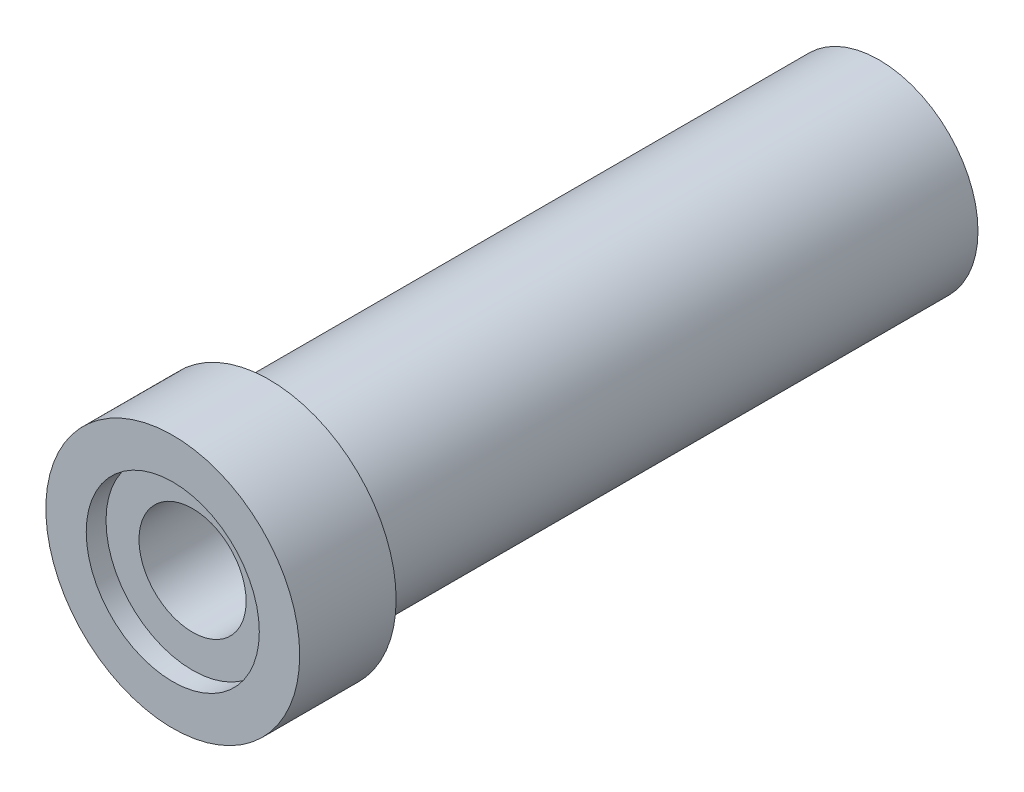
ISO-10303-21;
HEADER;
FILE_DESCRIPTION(('STEP AP214'),'2;1');
FILE_NAME('part.step','',(''),(''),'','','');
FILE_SCHEMA(('AUTOMOTIVE_DESIGN { 1 0 10303 214 1 1 1 1 }'));
ENDSEC;
DATA;
#1=APPLICATION_CONTEXT('core data for automotive mechanical design processes');
#2=APPLICATION_PROTOCOL_DEFINITION('international standard','automotive_design',2000,#1);
#3=PRODUCT_CONTEXT('',#1,'mechanical');
#4=PRODUCT('Part','Part','',(#3));
#5=PRODUCT_RELATED_PRODUCT_CATEGORY('part','',(#4));
#6=PRODUCT_DEFINITION_FORMATION('','',#4);
#7=PRODUCT_DEFINITION_CONTEXT('part definition',#1,'design');
#8=PRODUCT_DEFINITION('design','',#6,#7);
#9=PRODUCT_DEFINITION_SHAPE('','',#8);
#10=(LENGTH_UNIT() NAMED_UNIT(*) SI_UNIT(.MILLI.,.METRE.));
#11=(NAMED_UNIT(*) PLANE_ANGLE_UNIT() SI_UNIT($,.RADIAN.));
#12=(NAMED_UNIT(*) SI_UNIT($,.STERADIAN.) SOLID_ANGLE_UNIT());
#13=UNCERTAINTY_MEASURE_WITH_UNIT(LENGTH_MEASURE(1.E-05),#10,'distance_accuracy_value','');
#14=(GEOMETRIC_REPRESENTATION_CONTEXT(3) GLOBAL_UNCERTAINTY_ASSIGNED_CONTEXT((#13)) GLOBAL_UNIT_ASSIGNED_CONTEXT((#10,
#11,#12)) REPRESENTATION_CONTEXT('',''));
#15=CARTESIAN_POINT('',(0.,0.,0.));
#16=DIRECTION('',(0.,0.,1.));
#17=DIRECTION('',(1.,0.,0.));
#18=AXIS2_PLACEMENT_3D('',#15,#16,#17);
#19=CARTESIAN_POINT('',(0.,0.,-7.));
#20=DIRECTION('',(0.,0.,-1.));
#21=DIRECTION('',(-1.,0.,0.));
#22=AXIS2_PLACEMENT_3D('',#19,#20,#21);
#23=PLANE('',#22);
#24=CARTESIAN_POINT('',(0.,0.,-7.));
#25=DIRECTION('',(0.,0.,-1.));
#26=DIRECTION('',(-1.,0.,0.));
#27=AXIS2_PLACEMENT_3D('',#24,#25,#26);
#28=CIRCLE('',#27,3.25);
#29=CARTESIAN_POINT('',(-3.25,0.,-7.));
#30=VERTEX_POINT('',#29);
#31=EDGE_CURVE('E273',#30,#30,#28,.T.);
#32=ORIENTED_EDGE('',*,*,#31,.F.);
#33=EDGE_LOOP('',(#32));
#34=FACE_BOUND('',#33,.T.);
#35=CARTESIAN_POINT('',(0.,0.,-7.));
#36=DIRECTION('',(0.,0.,-1.));
#37=DIRECTION('',(-1.,0.,0.));
#38=AXIS2_PLACEMENT_3D('',#35,#36,#37);
#39=CIRCLE('',#38,4.6);
#40=CARTESIAN_POINT('',(-4.6,0.,-7.));
#41=VERTEX_POINT('',#40);
#42=EDGE_CURVE('E355',#41,#41,#39,.T.);
#43=ORIENTED_EDGE('',*,*,#42,.T.);
#44=EDGE_LOOP('',(#43));
#45=FACE_BOUND('',#44,.T.);
#46=ADVANCED_FACE('F252',(#34,#45),#23,.T.);
#47=CARTESIAN_POINT('',(0.,0.,5.85));
#48=DIRECTION('',(0.,0.,-1.));
#49=DIRECTION('',(-1.,0.,0.));
#50=AXIS2_PLACEMENT_3D('',#47,#48,#49);
#51=CYLINDRICAL_SURFACE('',#50,3.25);
#52=CARTESIAN_POINT('',(0.,0.,4.65));
#53=DIRECTION('',(0.,0.,1.));
#54=DIRECTION('',(1.,0.,0.));
#55=AXIS2_PLACEMENT_3D('',#52,#53,#54);
#56=CIRCLE('',#55,3.25);
#57=CARTESIAN_POINT('',(3.25,0.,4.65));
#58=VERTEX_POINT('',#57);
#59=EDGE_CURVE('E256',#58,#58,#56,.T.);
#60=ORIENTED_EDGE('',*,*,#59,.T.);
#61=EDGE_LOOP('',(#60));
#62=FACE_BOUND('',#61,.T.);
#63=ORIENTED_EDGE('',*,*,#31,.T.);
#64=EDGE_LOOP('',(#63));
#65=FACE_BOUND('',#64,.T.);
#66=ADVANCED_FACE('F294',(#62,#65),#51,.F.);
#67=CARTESIAN_POINT('',(0.,0.,5.85));
#68=DIRECTION('',(0.,0.,1.));
#69=DIRECTION('',(1.,0.,0.));
#70=AXIS2_PLACEMENT_3D('',#67,#68,#69);
#71=PLANE('',#70);
#72=CARTESIAN_POINT('',(0.,0.,5.85));
#73=DIRECTION('',(0.,0.,1.));
#74=DIRECTION('',(1.,0.,0.));
#75=AXIS2_PLACEMENT_3D('',#72,#73,#74);
#76=CIRCLE('',#75,5.25);
#77=CARTESIAN_POINT('',(5.25,0.,5.85));
#78=VERTEX_POINT('',#77);
#79=EDGE_CURVE('E279',#78,#78,#76,.T.);
#80=ORIENTED_EDGE('',*,*,#79,.F.);
#81=EDGE_LOOP('',(#80));
#82=FACE_BOUND('',#81,.T.);
#83=CARTESIAN_POINT('',(0.,0.,5.85));
#84=DIRECTION('',(0.,0.,1.));
#85=DIRECTION('',(1.,0.,0.));
#86=AXIS2_PLACEMENT_3D('',#83,#84,#85);
#87=CIRCLE('',#86,7.7);
#88=CARTESIAN_POINT('',(7.7,0.,5.85));
#89=VERTEX_POINT('',#88);
#90=EDGE_CURVE('E261',#89,#89,#87,.T.);
#91=ORIENTED_EDGE('',*,*,#90,.T.);
#92=EDGE_LOOP('',(#91));
#93=FACE_BOUND('',#92,.T.);
#94=ADVANCED_FACE('F310',(#82,#93),#71,.T.);
#95=CARTESIAN_POINT('',(0.,0.,0.));
#96=DIRECTION('',(0.,0.,1.));
#97=DIRECTION('',(1.,0.,0.));
#98=AXIS2_PLACEMENT_3D('',#95,#96,#97);
#99=PLANE('',#98);
#100=CARTESIAN_POINT('',(0.,0.,0.));
#101=DIRECTION('',(0.,0.,-1.));
#102=DIRECTION('',(-1.,0.,0.));
#103=AXIS2_PLACEMENT_3D('',#100,#101,#102);
#104=CIRCLE('',#103,6.);
#105=CARTESIAN_POINT('',(-6.,0.,0.));
#106=VERTEX_POINT('',#105);
#107=EDGE_CURVE('E11',#106,#106,#104,.T.);
#108=ORIENTED_EDGE('',*,*,#107,.F.);
#109=EDGE_LOOP('',(#108));
#110=FACE_BOUND('',#109,.T.);
#111=CARTESIAN_POINT('',(0.,0.,0.));
#112=DIRECTION('',(0.,0.,1.));
#113=DIRECTION('',(1.,0.,0.));
#114=AXIS2_PLACEMENT_3D('',#111,#112,#113);
#115=CIRCLE('',#114,7.7);
#116=CARTESIAN_POINT('',(7.7,0.,0.));
#117=VERTEX_POINT('',#116);
#118=EDGE_CURVE('E269',#117,#117,#115,.T.);
#119=ORIENTED_EDGE('',*,*,#118,.F.);
#120=EDGE_LOOP('',(#119));
#121=FACE_BOUND('',#120,.T.);
#122=ADVANCED_FACE('F313',(#110,#121),#99,.F.);
#123=CARTESIAN_POINT('',(0.,0.,5.85));
#124=DIRECTION('',(0.,0.,-1.));
#125=DIRECTION('',(-1.,0.,0.));
#126=AXIS2_PLACEMENT_3D('',#123,#124,#125);
#127=CYLINDRICAL_SURFACE('',#126,7.7);
#128=ORIENTED_EDGE('',*,*,#90,.F.);
#129=EDGE_LOOP('',(#128));
#130=FACE_BOUND('',#129,.T.);
#131=ORIENTED_EDGE('',*,*,#118,.T.);
#132=EDGE_LOOP('',(#131));
#133=FACE_BOUND('',#132,.T.);
#134=ADVANCED_FACE('F254',(#130,#133),#127,.T.);
#135=CARTESIAN_POINT('',(0.,0.,4.65));
#136=DIRECTION('',(0.,0.,1.));
#137=DIRECTION('',(1.,0.,0.));
#138=AXIS2_PLACEMENT_3D('',#135,#136,#137);
#139=CYLINDRICAL_SURFACE('',#138,5.25);
#140=CARTESIAN_POINT('',(0.,0.,4.65));
#141=DIRECTION('',(0.,0.,1.));
#142=DIRECTION('',(1.,0.,0.));
#143=AXIS2_PLACEMENT_3D('',#140,#141,#142);
#144=CIRCLE('',#143,5.25);
#145=CARTESIAN_POINT('',(5.25,0.,4.65));
#146=VERTEX_POINT('',#145);
#147=EDGE_CURVE('E275',#146,#146,#144,.T.);
#148=ORIENTED_EDGE('',*,*,#147,.F.);
#149=EDGE_LOOP('',(#148));
#150=FACE_BOUND('',#149,.T.);
#151=ORIENTED_EDGE('',*,*,#79,.T.);
#152=EDGE_LOOP('',(#151));
#153=FACE_BOUND('',#152,.T.);
#154=ADVANCED_FACE('F301',(#150,#153),#139,.F.);
#155=CARTESIAN_POINT('',(0.,0.,4.65));
#156=DIRECTION('',(0.,0.,1.));
#157=DIRECTION('',(1.,0.,0.));
#158=AXIS2_PLACEMENT_3D('',#155,#156,#157);
#159=PLANE('',#158);
#160=ORIENTED_EDGE('',*,*,#59,.F.);
#161=EDGE_LOOP('',(#160));
#162=FACE_BOUND('',#161,.T.);
#163=ORIENTED_EDGE('',*,*,#147,.T.);
#164=EDGE_LOOP('',(#163));
#165=FACE_BOUND('',#164,.T.);
#166=ADVANCED_FACE('F297',(#162,#165),#159,.T.);
#167=CARTESIAN_POINT('',(0.,0.,-7.));
#168=DIRECTION('',(0.,0.,1.));
#169=DIRECTION('',(1.,0.,0.));
#170=AXIS2_PLACEMENT_3D('',#167,#168,#169);
#171=CYLINDRICAL_SURFACE('',#170,6.);
#172=ORIENTED_EDGE('',*,*,#107,.T.);
#173=EDGE_LOOP('',(#172));
#174=FACE_BOUND('',#173,.T.);
#175=CARTESIAN_POINT('',(0.,0.,-37.));
#176=DIRECTION('',(0.,0.,-1.));
#177=DIRECTION('',(-1.,0.,0.));
#178=AXIS2_PLACEMENT_3D('',#175,#176,#177);
#179=CIRCLE('',#178,6.);
#180=CARTESIAN_POINT('',(-6.,0.,-37.));
#181=VERTEX_POINT('',#180);
#182=EDGE_CURVE('E344',#181,#181,#179,.T.);
#183=ORIENTED_EDGE('',*,*,#182,.F.);
#184=EDGE_LOOP('',(#183));
#185=FACE_BOUND('',#184,.T.);
#186=ADVANCED_FACE('F300',(#174,#185),#171,.T.);
#187=CARTESIAN_POINT('',(0.,0.,-37.));
#188=DIRECTION('',(0.,0.,1.));
#189=DIRECTION('',(1.,0.,0.));
#190=AXIS2_PLACEMENT_3D('',#187,#188,#189);
#191=CYLINDRICAL_SURFACE('',#190,4.6);
#192=CARTESIAN_POINT('',(0.,0.,-37.));
#193=DIRECTION('',(0.,0.,-1.));
#194=DIRECTION('',(-1.,0.,0.));
#195=AXIS2_PLACEMENT_3D('',#192,#193,#194);
#196=CIRCLE('',#195,4.6);
#197=CARTESIAN_POINT('',(-4.6,0.,-37.));
#198=VERTEX_POINT('',#197);
#199=EDGE_CURVE('E347',#198,#198,#196,.T.);
#200=ORIENTED_EDGE('',*,*,#199,.T.);
#201=EDGE_LOOP('',(#200));
#202=FACE_BOUND('',#201,.T.);
#203=ORIENTED_EDGE('',*,*,#42,.F.);
#204=EDGE_LOOP('',(#203));
#205=FACE_BOUND('',#204,.T.);
#206=ADVANCED_FACE('F333',(#202,#205),#191,.F.);
#207=CARTESIAN_POINT('',(0.,0.,-37.));
#208=DIRECTION('',(0.,0.,-1.));
#209=DIRECTION('',(-1.,0.,0.));
#210=AXIS2_PLACEMENT_3D('',#207,#208,#209);
#211=PLANE('',#210);
#212=ORIENTED_EDGE('',*,*,#199,.F.);
#213=EDGE_LOOP('',(#212));
#214=FACE_BOUND('',#213,.T.);
#215=ORIENTED_EDGE('',*,*,#182,.T.);
#216=EDGE_LOOP('',(#215));
#217=FACE_BOUND('',#216,.T.);
#218=ADVANCED_FACE('F339',(#214,#217),#211,.T.);
#219=CLOSED_SHELL('',(#46,#66,#94,#122,#134,#154,#166,#186,#206,#218));
#220=MANIFOLD_SOLID_BREP('B2',#219);
#221=ADVANCED_BREP_SHAPE_REPRESENTATION('',(#18,#220),#14);
#222=SHAPE_DEFINITION_REPRESENTATION(#9,#221);
ENDSEC;
END-ISO-10303-21;
